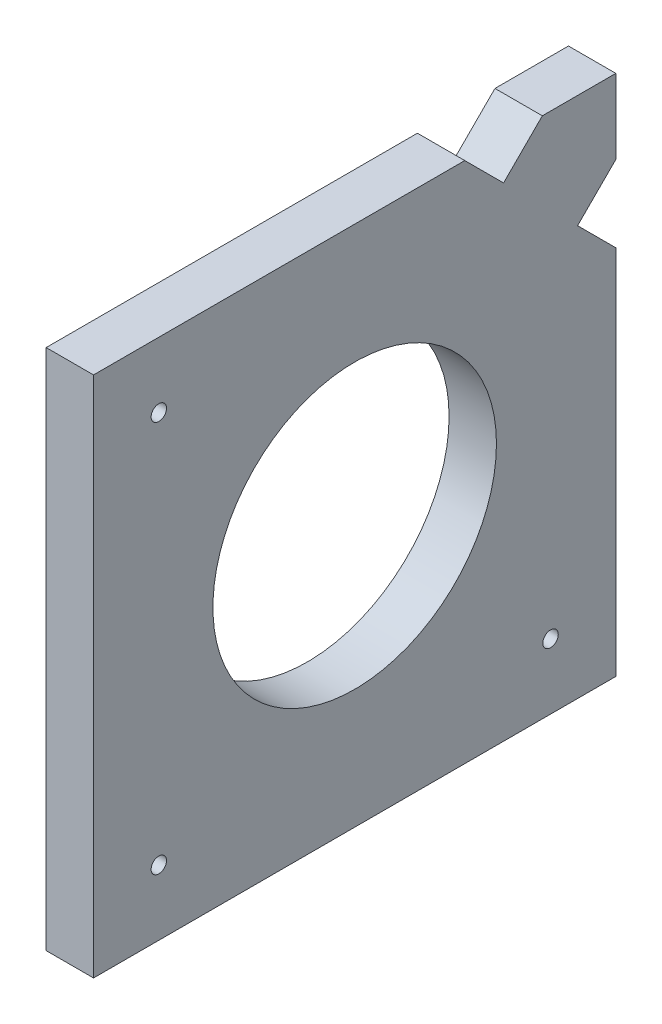
ISO-10303-21;
HEADER;
FILE_DESCRIPTION(('STEP AP214'),'2;1');
FILE_NAME('part.step','',(''),(''),'','','');
FILE_SCHEMA(('AUTOMOTIVE_DESIGN { 1 0 10303 214 1 1 1 1 }'));
ENDSEC;
DATA;
#1=APPLICATION_CONTEXT('core data for automotive mechanical design processes');
#2=APPLICATION_PROTOCOL_DEFINITION('international standard','automotive_design',2000,#1);
#3=PRODUCT_CONTEXT('',#1,'mechanical');
#4=PRODUCT('Part','Part','',(#3));
#5=PRODUCT_RELATED_PRODUCT_CATEGORY('part','',(#4));
#6=PRODUCT_DEFINITION_FORMATION('','',#4);
#7=PRODUCT_DEFINITION_CONTEXT('part definition',#1,'design');
#8=PRODUCT_DEFINITION('design','',#6,#7);
#9=PRODUCT_DEFINITION_SHAPE('','',#8);
#10=(LENGTH_UNIT() NAMED_UNIT(*) SI_UNIT(.MILLI.,.METRE.));
#11=(NAMED_UNIT(*) PLANE_ANGLE_UNIT() SI_UNIT($,.RADIAN.));
#12=(NAMED_UNIT(*) SI_UNIT($,.STERADIAN.) SOLID_ANGLE_UNIT());
#13=UNCERTAINTY_MEASURE_WITH_UNIT(LENGTH_MEASURE(1.E-05),#10,'distance_accuracy_value','');
#14=(GEOMETRIC_REPRESENTATION_CONTEXT(3) GLOBAL_UNCERTAINTY_ASSIGNED_CONTEXT((#13)) GLOBAL_UNIT_ASSIGNED_CONTEXT((#10,
#11,#12)) REPRESENTATION_CONTEXT('',''));
#15=CARTESIAN_POINT('',(0.,0.,0.));
#16=DIRECTION('',(0.,0.,1.));
#17=DIRECTION('',(1.,0.,0.));
#18=AXIS2_PLACEMENT_3D('',#15,#16,#17);
#19=CARTESIAN_POINT('',(6.35,0.,0.));
#20=DIRECTION('',(-1.,0.,0.));
#21=DIRECTION('',(0.,0.,1.));
#22=AXIS2_PLACEMENT_3D('',#19,#20,#21);
#23=PLANE('',#22);
#24=CARTESIAN_POINT('',(6.35,8.75000000000002,-61.25));
#25=DIRECTION('',(1.,0.,0.));
#26=DIRECTION('',(0.,0.,-1.));
#27=AXIS2_PLACEMENT_3D('',#24,#25,#26);
#28=CIRCLE('',#27,1.03251);
#29=CARTESIAN_POINT('',(6.35,8.75000000000002,-62.28251));
#30=VERTEX_POINT('',#29);
#31=EDGE_CURVE('E226',#30,#30,#28,.T.);
#32=ORIENTED_EDGE('',*,*,#31,.F.);
#33=EDGE_LOOP('',(#32));
#34=FACE_BOUND('',#33,.T.);
#35=CARTESIAN_POINT('',(6.35,8.75000000000002,-8.74999999999999));
#36=DIRECTION('',(1.,0.,0.));
#37=DIRECTION('',(0.,0.,1.));
#38=AXIS2_PLACEMENT_3D('',#35,#36,#37);
#39=CIRCLE('',#38,1.03251);
#40=CARTESIAN_POINT('',(6.35,8.75000000000002,-7.71748999999999));
#41=VERTEX_POINT('',#40);
#42=EDGE_CURVE('E220',#41,#41,#39,.T.);
#43=ORIENTED_EDGE('',*,*,#42,.F.);
#44=EDGE_LOOP('',(#43));
#45=FACE_BOUND('',#44,.T.);
#46=CARTESIAN_POINT('',(6.35,61.25,-8.74999999999999));
#47=DIRECTION('',(1.,0.,0.));
#48=DIRECTION('',(0.,0.,-1.));
#49=AXIS2_PLACEMENT_3D('',#46,#47,#48);
#50=CIRCLE('',#49,1.03251);
#51=CARTESIAN_POINT('',(6.35,61.25,-9.78250999999999));
#52=VERTEX_POINT('',#51);
#53=EDGE_CURVE('E214',#52,#52,#50,.T.);
#54=ORIENTED_EDGE('',*,*,#53,.F.);
#55=EDGE_LOOP('',(#54));
#56=FACE_BOUND('',#55,.T.);
#57=DIRECTION('',(0.,-1.,0.));
#58=VECTOR('',#57,1.);
#59=CARTESIAN_POINT('',(6.35,0.,0.));
#60=LINE('',#59,#58);
#61=CARTESIAN_POINT('',(6.35,70.,0.));
#62=VERTEX_POINT('',#61);
#63=CARTESIAN_POINT('',(6.35,0.,0.));
#64=VERTEX_POINT('',#63);
#65=EDGE_CURVE('E160',#62,#64,#60,.T.);
#66=ORIENTED_EDGE('',*,*,#65,.T.);
#67=DIRECTION('',(0.,0.,-1.));
#68=VECTOR('',#67,1.);
#69=CARTESIAN_POINT('',(6.35,0.,0.));
#70=LINE('',#69,#68);
#71=CARTESIAN_POINT('',(6.35,0.,-70.));
#72=VERTEX_POINT('',#71);
#73=EDGE_CURVE('E98',#64,#72,#70,.T.);
#74=ORIENTED_EDGE('',*,*,#73,.T.);
#75=DIRECTION('',(0.,1.,0.));
#76=VECTOR('',#75,1.);
#77=CARTESIAN_POINT('',(6.35,49.7566150142179,-70.));
#78=LINE('',#77,#76);
#79=CARTESIAN_POINT('',(6.35,49.7566150142179,-70.));
#80=VERTEX_POINT('',#79);
#81=EDGE_CURVE('E181',#72,#80,#78,.T.);
#82=ORIENTED_EDGE('',*,*,#81,.T.);
#83=DIRECTION('',(0.,0.707106781186539,0.707106781186556));
#84=VECTOR('',#83,1.);
#85=CARTESIAN_POINT('',(6.35,54.8841313668253,-64.8724836473926));
#86=LINE('',#85,#84);
#87=CARTESIAN_POINT('',(6.35,54.8841313668253,-64.8724836473926));
#88=VERTEX_POINT('',#87);
#89=EDGE_CURVE('E200',#80,#88,#86,.T.);
#90=ORIENTED_EDGE('',*,*,#89,.T.);
#91=DIRECTION('',(0.,0.707106781186557,-0.707106781186538));
#92=VECTOR('',#91,1.);
#93=CARTESIAN_POINT('',(6.35,60.0116477194329,-70.));
#94=LINE('',#93,#92);
#95=CARTESIAN_POINT('',(6.35,60.0116477194329,-70.));
#96=VERTEX_POINT('',#95);
#97=EDGE_CURVE('E197',#88,#96,#94,.T.);
#98=ORIENTED_EDGE('',*,*,#97,.T.);
#99=DIRECTION('',(0.,1.,0.));
#100=VECTOR('',#99,1.);
#101=CARTESIAN_POINT('',(6.35,70.,-70.));
#102=LINE('',#101,#100);
#103=CARTESIAN_POINT('',(6.35,70.,-70.));
#104=VERTEX_POINT('',#103);
#105=EDGE_CURVE('E199',#96,#104,#102,.T.);
#106=ORIENTED_EDGE('',*,*,#105,.T.);
#107=DIRECTION('',(0.,0.,1.));
#108=VECTOR('',#107,1.);
#109=CARTESIAN_POINT('',(6.35,70.,-60.1486352668631));
#110=LINE('',#109,#108);
#111=CARTESIAN_POINT('',(6.35,70.,-60.1486352668631));
#112=VERTEX_POINT('',#111);
#113=EDGE_CURVE('E123',#104,#112,#110,.T.);
#114=ORIENTED_EDGE('',*,*,#113,.T.);
#115=DIRECTION('',(0.,-0.707106781186557,0.707106781186538));
#116=VECTOR('',#115,1.);
#117=CARTESIAN_POINT('',(6.35,64.8039898736772,-54.9526251405404));
#118=LINE('',#117,#116);
#119=CARTESIAN_POINT('',(6.35,64.8039898736772,-54.9526251405404));
#120=VERTEX_POINT('',#119);
#121=EDGE_CURVE('E117',#112,#120,#118,.T.);
#122=ORIENTED_EDGE('',*,*,#121,.T.);
#123=DIRECTION('',(0.,0.707106781186539,0.707106781186556));
#124=VECTOR('',#123,1.);
#125=CARTESIAN_POINT('',(6.35,64.8039898736772,-54.9526251405404));
#126=LINE('',#125,#124);
#127=CARTESIAN_POINT('',(6.35,70.,-49.7566150142174));
#128=VERTEX_POINT('',#127);
#129=EDGE_CURVE('E121',#120,#128,#126,.T.);
#130=ORIENTED_EDGE('',*,*,#129,.T.);
#131=DIRECTION('',(0.,0.,1.));
#132=VECTOR('',#131,1.);
#133=CARTESIAN_POINT('',(6.35,70.,0.));
#134=LINE('',#133,#132);
#135=EDGE_CURVE('E49',#128,#62,#134,.T.);
#136=ORIENTED_EDGE('',*,*,#135,.T.);
#137=EDGE_LOOP('',(#66,#74,#82,#90,#98,#106,#114,#122,#130,#136));
#138=FACE_BOUND('',#137,.T.);
#139=CARTESIAN_POINT('',(6.35,35.,-35.));
#140=DIRECTION('',(1.,0.,0.));
#141=DIRECTION('',(0.,0.,-1.));
#142=AXIS2_PLACEMENT_3D('',#139,#140,#141);
#143=CIRCLE('',#142,19.);
#144=CARTESIAN_POINT('',(6.35,35.,-54.));
#145=VERTEX_POINT('',#144);
#146=EDGE_CURVE('E145',#145,#145,#143,.T.);
#147=ORIENTED_EDGE('',*,*,#146,.F.);
#148=EDGE_LOOP('',(#147));
#149=FACE_BOUND('',#148,.T.);
#150=ADVANCED_FACE('F32',(#34,#45,#56,#138,#149),#23,.F.);
#151=CARTESIAN_POINT('',(0.,0.,0.));
#152=DIRECTION('',(-1.,0.,0.));
#153=DIRECTION('',(0.,0.,1.));
#154=AXIS2_PLACEMENT_3D('',#151,#152,#153);
#155=PLANE('',#154);
#156=CARTESIAN_POINT('',(0.,8.75000000000002,-61.25));
#157=DIRECTION('',(1.,0.,0.));
#158=DIRECTION('',(0.,0.,-1.));
#159=AXIS2_PLACEMENT_3D('',#156,#157,#158);
#160=CIRCLE('',#159,1.03251);
#161=CARTESIAN_POINT('',(0.,8.75000000000002,-62.28251));
#162=VERTEX_POINT('',#161);
#163=EDGE_CURVE('E223',#162,#162,#160,.T.);
#164=ORIENTED_EDGE('',*,*,#163,.T.);
#165=EDGE_LOOP('',(#164));
#166=FACE_BOUND('',#165,.T.);
#167=CARTESIAN_POINT('',(0.,8.75000000000002,-8.74999999999999));
#168=DIRECTION('',(1.,0.,0.));
#169=DIRECTION('',(0.,0.,1.));
#170=AXIS2_PLACEMENT_3D('',#167,#168,#169);
#171=CIRCLE('',#170,1.03251);
#172=CARTESIAN_POINT('',(0.,8.75000000000002,-7.71748999999999));
#173=VERTEX_POINT('',#172);
#174=EDGE_CURVE('E217',#173,#173,#171,.T.);
#175=ORIENTED_EDGE('',*,*,#174,.T.);
#176=EDGE_LOOP('',(#175));
#177=FACE_BOUND('',#176,.T.);
#178=CARTESIAN_POINT('',(0.,61.25,-8.74999999999999));
#179=DIRECTION('',(1.,0.,0.));
#180=DIRECTION('',(0.,0.,-1.));
#181=AXIS2_PLACEMENT_3D('',#178,#179,#180);
#182=CIRCLE('',#181,1.03251);
#183=CARTESIAN_POINT('',(0.,61.25,-9.78250999999999));
#184=VERTEX_POINT('',#183);
#185=EDGE_CURVE('E211',#184,#184,#182,.T.);
#186=ORIENTED_EDGE('',*,*,#185,.T.);
#187=EDGE_LOOP('',(#186));
#188=FACE_BOUND('',#187,.T.);
#189=DIRECTION('',(0.,-1.,0.));
#190=VECTOR('',#189,1.);
#191=CARTESIAN_POINT('',(0.,0.,0.));
#192=LINE('',#191,#190);
#193=CARTESIAN_POINT('',(0.,70.,0.));
#194=VERTEX_POINT('',#193);
#195=CARTESIAN_POINT('',(0.,0.,0.));
#196=VERTEX_POINT('',#195);
#197=EDGE_CURVE('E141',#194,#196,#192,.T.);
#198=ORIENTED_EDGE('',*,*,#197,.F.);
#199=DIRECTION('',(0.,0.,1.));
#200=VECTOR('',#199,1.);
#201=CARTESIAN_POINT('',(0.,70.,0.));
#202=LINE('',#201,#200);
#203=CARTESIAN_POINT('',(0.,70.,-49.7566150142174));
#204=VERTEX_POINT('',#203);
#205=EDGE_CURVE('E90',#204,#194,#202,.T.);
#206=ORIENTED_EDGE('',*,*,#205,.F.);
#207=DIRECTION('',(0.,0.707106781186539,0.707106781186556));
#208=VECTOR('',#207,1.);
#209=CARTESIAN_POINT('',(0.,64.8039898736772,-54.9526251405404));
#210=LINE('',#209,#208);
#211=CARTESIAN_POINT('',(0.,64.8039898736772,-54.9526251405404));
#212=VERTEX_POINT('',#211);
#213=EDGE_CURVE('E84',#212,#204,#210,.T.);
#214=ORIENTED_EDGE('',*,*,#213,.F.);
#215=DIRECTION('',(0.,-0.707106781186557,0.707106781186538));
#216=VECTOR('',#215,1.);
#217=CARTESIAN_POINT('',(0.,64.8039898736772,-54.9526251405404));
#218=LINE('',#217,#216);
#219=CARTESIAN_POINT('',(0.,70.,-60.1486352668631));
#220=VERTEX_POINT('',#219);
#221=EDGE_CURVE('E131',#220,#212,#218,.T.);
#222=ORIENTED_EDGE('',*,*,#221,.F.);
#223=DIRECTION('',(0.,0.,1.));
#224=VECTOR('',#223,1.);
#225=CARTESIAN_POINT('',(0.,70.,-60.1486352668631));
#226=LINE('',#225,#224);
#227=CARTESIAN_POINT('',(0.,70.,-70.));
#228=VERTEX_POINT('',#227);
#229=EDGE_CURVE('E155',#228,#220,#226,.T.);
#230=ORIENTED_EDGE('',*,*,#229,.F.);
#231=DIRECTION('',(0.,1.,0.));
#232=VECTOR('',#231,1.);
#233=CARTESIAN_POINT('',(0.,70.,-70.));
#234=LINE('',#233,#232);
#235=CARTESIAN_POINT('',(0.,60.0116477194329,-70.));
#236=VERTEX_POINT('',#235);
#237=EDGE_CURVE('E153',#236,#228,#234,.T.);
#238=ORIENTED_EDGE('',*,*,#237,.F.);
#239=DIRECTION('',(0.,0.707106781186557,-0.707106781186538));
#240=VECTOR('',#239,1.);
#241=CARTESIAN_POINT('',(0.,60.0116477194329,-70.));
#242=LINE('',#241,#240);
#243=CARTESIAN_POINT('',(0.,54.8841313668253,-64.8724836473926));
#244=VERTEX_POINT('',#243);
#245=EDGE_CURVE('E151',#244,#236,#242,.T.);
#246=ORIENTED_EDGE('',*,*,#245,.F.);
#247=DIRECTION('',(0.,0.707106781186539,0.707106781186556));
#248=VECTOR('',#247,1.);
#249=CARTESIAN_POINT('',(0.,54.8841313668253,-64.8724836473926));
#250=LINE('',#249,#248);
#251=CARTESIAN_POINT('',(0.,49.7566150142179,-70.));
#252=VERTEX_POINT('',#251);
#253=EDGE_CURVE('E149',#252,#244,#250,.T.);
#254=ORIENTED_EDGE('',*,*,#253,.F.);
#255=DIRECTION('',(0.,1.,0.));
#256=VECTOR('',#255,1.);
#257=CARTESIAN_POINT('',(0.,49.7566150142179,-70.));
#258=LINE('',#257,#256);
#259=CARTESIAN_POINT('',(0.,0.,-70.));
#260=VERTEX_POINT('',#259);
#261=EDGE_CURVE('E147',#260,#252,#258,.T.);
#262=ORIENTED_EDGE('',*,*,#261,.F.);
#263=DIRECTION('',(0.,0.,-1.));
#264=VECTOR('',#263,1.);
#265=CARTESIAN_POINT('',(0.,0.,0.));
#266=LINE('',#265,#264);
#267=EDGE_CURVE('E144',#196,#260,#266,.T.);
#268=ORIENTED_EDGE('',*,*,#267,.F.);
#269=EDGE_LOOP('',(#198,#206,#214,#222,#230,#238,#246,#254,#262,#268));
#270=FACE_BOUND('',#269,.T.);
#271=CARTESIAN_POINT('',(0.,35.,-35.));
#272=DIRECTION('',(1.,0.,0.));
#273=DIRECTION('',(0.,0.,-1.));
#274=AXIS2_PLACEMENT_3D('',#271,#272,#273);
#275=CIRCLE('',#274,19.);
#276=CARTESIAN_POINT('',(0.,35.,-54.));
#277=VERTEX_POINT('',#276);
#278=EDGE_CURVE('E208',#277,#277,#275,.T.);
#279=ORIENTED_EDGE('',*,*,#278,.T.);
#280=EDGE_LOOP('',(#279));
#281=FACE_BOUND('',#280,.T.);
#282=ADVANCED_FACE('F185',(#166,#177,#188,#270,#281),#155,.T.);
#283=CARTESIAN_POINT('',(6.35,0.,0.));
#284=DIRECTION('',(0.,0.,-1.));
#285=DIRECTION('',(0.,1.,0.));
#286=AXIS2_PLACEMENT_3D('',#283,#284,#285);
#287=PLANE('',#286);
#288=ORIENTED_EDGE('',*,*,#197,.T.);
#289=DIRECTION('',(-1.,0.,0.));
#290=VECTOR('',#289,1.);
#291=CARTESIAN_POINT('',(6.35,0.,0.));
#292=LINE('',#291,#290);
#293=EDGE_CURVE('E11',#64,#196,#292,.T.);
#294=ORIENTED_EDGE('',*,*,#293,.F.);
#295=ORIENTED_EDGE('',*,*,#65,.F.);
#296=DIRECTION('',(-1.,0.,0.));
#297=VECTOR('',#296,1.);
#298=CARTESIAN_POINT('',(6.35,70.,0.));
#299=LINE('',#298,#297);
#300=EDGE_CURVE('E137',#62,#194,#299,.T.);
#301=ORIENTED_EDGE('',*,*,#300,.T.);
#302=EDGE_LOOP('',(#288,#294,#295,#301));
#303=FACE_BOUND('',#302,.T.);
#304=ADVANCED_FACE('F34',(#303),#287,.F.);
#305=CARTESIAN_POINT('',(6.35,0.,0.));
#306=DIRECTION('',(0.,1.,0.));
#307=DIRECTION('',(0.,0.,1.));
#308=AXIS2_PLACEMENT_3D('',#305,#306,#307);
#309=PLANE('',#308);
#310=ORIENTED_EDGE('',*,*,#267,.T.);
#311=DIRECTION('',(-1.,0.,0.));
#312=VECTOR('',#311,1.);
#313=CARTESIAN_POINT('',(6.35,0.,-70.));
#314=LINE('',#313,#312);
#315=EDGE_CURVE('E41',#72,#260,#314,.T.);
#316=ORIENTED_EDGE('',*,*,#315,.F.);
#317=ORIENTED_EDGE('',*,*,#73,.F.);
#318=ORIENTED_EDGE('',*,*,#293,.T.);
#319=EDGE_LOOP('',(#310,#316,#317,#318));
#320=FACE_BOUND('',#319,.T.);
#321=ADVANCED_FACE('F285',(#320),#309,.F.);
#322=CARTESIAN_POINT('',(6.35,49.7566150142179,-70.));
#323=DIRECTION('',(0.,0.,1.));
#324=DIRECTION('',(1.,0.,0.));
#325=AXIS2_PLACEMENT_3D('',#322,#323,#324);
#326=PLANE('',#325);
#327=ORIENTED_EDGE('',*,*,#261,.T.);
#328=DIRECTION('',(-1.,0.,0.));
#329=VECTOR('',#328,1.);
#330=CARTESIAN_POINT('',(6.35,49.7566150142179,-70.));
#331=LINE('',#330,#329);
#332=EDGE_CURVE('E173',#80,#252,#331,.T.);
#333=ORIENTED_EDGE('',*,*,#332,.F.);
#334=ORIENTED_EDGE('',*,*,#81,.F.);
#335=ORIENTED_EDGE('',*,*,#315,.T.);
#336=EDGE_LOOP('',(#327,#333,#334,#335));
#337=FACE_BOUND('',#336,.T.);
#338=ADVANCED_FACE('F179',(#337),#326,.F.);
#339=CARTESIAN_POINT('',(6.35,54.8841313668253,-64.8724836473926));
#340=DIRECTION('',(0.,-0.707106781186556,0.707106781186539));
#341=DIRECTION('',(0.,-0.707106781186539,-0.707106781186556));
#342=AXIS2_PLACEMENT_3D('',#339,#340,#341);
#343=PLANE('',#342);
#344=ORIENTED_EDGE('',*,*,#253,.T.);
#345=DIRECTION('',(-1.,0.,0.));
#346=VECTOR('',#345,1.);
#347=CARTESIAN_POINT('',(6.35,54.8841313668253,-64.8724836473926));
#348=LINE('',#347,#346);
#349=EDGE_CURVE('E170',#88,#244,#348,.T.);
#350=ORIENTED_EDGE('',*,*,#349,.F.);
#351=ORIENTED_EDGE('',*,*,#89,.F.);
#352=ORIENTED_EDGE('',*,*,#332,.T.);
#353=EDGE_LOOP('',(#344,#350,#351,#352));
#354=FACE_BOUND('',#353,.T.);
#355=ADVANCED_FACE('F191',(#354),#343,.F.);
#356=CARTESIAN_POINT('',(6.35,60.0116477194329,-70.));
#357=DIRECTION('',(0.,0.707106781186538,0.707106781186557));
#358=DIRECTION('',(0.,-0.707106781186557,0.707106781186538));
#359=AXIS2_PLACEMENT_3D('',#356,#357,#358);
#360=PLANE('',#359);
#361=ORIENTED_EDGE('',*,*,#245,.T.);
#362=DIRECTION('',(-1.,0.,0.));
#363=VECTOR('',#362,1.);
#364=CARTESIAN_POINT('',(6.35,60.0116477194329,-70.));
#365=LINE('',#364,#363);
#366=EDGE_CURVE('E167',#96,#236,#365,.T.);
#367=ORIENTED_EDGE('',*,*,#366,.F.);
#368=ORIENTED_EDGE('',*,*,#97,.F.);
#369=ORIENTED_EDGE('',*,*,#349,.T.);
#370=EDGE_LOOP('',(#361,#367,#368,#369));
#371=FACE_BOUND('',#370,.T.);
#372=ADVANCED_FACE('F195',(#371),#360,.F.);
#373=CARTESIAN_POINT('',(6.35,70.,-70.));
#374=DIRECTION('',(0.,0.,1.));
#375=DIRECTION('',(1.,0.,0.));
#376=AXIS2_PLACEMENT_3D('',#373,#374,#375);
#377=PLANE('',#376);
#378=ORIENTED_EDGE('',*,*,#237,.T.);
#379=DIRECTION('',(-1.,0.,0.));
#380=VECTOR('',#379,1.);
#381=CARTESIAN_POINT('',(6.35,70.,-70.));
#382=LINE('',#381,#380);
#383=EDGE_CURVE('E164',#104,#228,#382,.T.);
#384=ORIENTED_EDGE('',*,*,#383,.F.);
#385=ORIENTED_EDGE('',*,*,#105,.F.);
#386=ORIENTED_EDGE('',*,*,#366,.T.);
#387=EDGE_LOOP('',(#378,#384,#385,#386));
#388=FACE_BOUND('',#387,.T.);
#389=ADVANCED_FACE('F275',(#388),#377,.F.);
#390=CARTESIAN_POINT('',(6.35,70.,-60.1486352668631));
#391=DIRECTION('',(0.,-1.,0.));
#392=DIRECTION('',(0.,0.,-1.));
#393=AXIS2_PLACEMENT_3D('',#390,#391,#392);
#394=PLANE('',#393);
#395=ORIENTED_EDGE('',*,*,#229,.T.);
#396=DIRECTION('',(-1.,0.,0.));
#397=VECTOR('',#396,1.);
#398=CARTESIAN_POINT('',(6.35,70.,-60.1486352668631));
#399=LINE('',#398,#397);
#400=EDGE_CURVE('E132',#112,#220,#399,.T.);
#401=ORIENTED_EDGE('',*,*,#400,.F.);
#402=ORIENTED_EDGE('',*,*,#113,.F.);
#403=ORIENTED_EDGE('',*,*,#383,.T.);
#404=EDGE_LOOP('',(#395,#401,#402,#403));
#405=FACE_BOUND('',#404,.T.);
#406=ADVANCED_FACE('F272',(#405),#394,.F.);
#407=CARTESIAN_POINT('',(6.35,64.8039898736772,-54.9526251405404));
#408=DIRECTION('',(0.,-0.707106781186538,-0.707106781186557));
#409=DIRECTION('',(0.,0.707106781186557,-0.707106781186538));
#410=AXIS2_PLACEMENT_3D('',#407,#408,#409);
#411=PLANE('',#410);
#412=ORIENTED_EDGE('',*,*,#221,.T.);
#413=DIRECTION('',(-1.,0.,0.));
#414=VECTOR('',#413,1.);
#415=CARTESIAN_POINT('',(6.35,64.8039898736772,-54.9526251405404));
#416=LINE('',#415,#414);
#417=EDGE_CURVE('E128',#120,#212,#416,.T.);
#418=ORIENTED_EDGE('',*,*,#417,.F.);
#419=ORIENTED_EDGE('',*,*,#121,.F.);
#420=ORIENTED_EDGE('',*,*,#400,.T.);
#421=EDGE_LOOP('',(#412,#418,#419,#420));
#422=FACE_BOUND('',#421,.T.);
#423=ADVANCED_FACE('F129',(#422),#411,.F.);
#424=CARTESIAN_POINT('',(6.35,64.8039898736772,-54.9526251405404));
#425=DIRECTION('',(0.,-0.707106781186556,0.707106781186539));
#426=DIRECTION('',(0.,-0.707106781186539,-0.707106781186556));
#427=AXIS2_PLACEMENT_3D('',#424,#425,#426);
#428=PLANE('',#427);
#429=ORIENTED_EDGE('',*,*,#213,.T.);
#430=DIRECTION('',(-1.,0.,0.));
#431=VECTOR('',#430,1.);
#432=CARTESIAN_POINT('',(6.35,70.,-49.7566150142174));
#433=LINE('',#432,#431);
#434=EDGE_CURVE('E133',#128,#204,#433,.T.);
#435=ORIENTED_EDGE('',*,*,#434,.F.);
#436=ORIENTED_EDGE('',*,*,#129,.F.);
#437=ORIENTED_EDGE('',*,*,#417,.T.);
#438=EDGE_LOOP('',(#429,#435,#436,#437));
#439=FACE_BOUND('',#438,.T.);
#440=ADVANCED_FACE('F135',(#439),#428,.F.);
#441=CARTESIAN_POINT('',(6.35,70.,0.));
#442=DIRECTION('',(0.,-1.,0.));
#443=DIRECTION('',(0.,0.,-1.));
#444=AXIS2_PLACEMENT_3D('',#441,#442,#443);
#445=PLANE('',#444);
#446=ORIENTED_EDGE('',*,*,#205,.T.);
#447=ORIENTED_EDGE('',*,*,#300,.F.);
#448=ORIENTED_EDGE('',*,*,#135,.F.);
#449=ORIENTED_EDGE('',*,*,#434,.T.);
#450=EDGE_LOOP('',(#446,#447,#448,#449));
#451=FACE_BOUND('',#450,.T.);
#452=ADVANCED_FACE('F259',(#451),#445,.F.);
#453=CARTESIAN_POINT('',(6.35,35.,-35.));
#454=DIRECTION('',(-1.,0.,0.));
#455=DIRECTION('',(0.,0.,1.));
#456=AXIS2_PLACEMENT_3D('',#453,#454,#455);
#457=CYLINDRICAL_SURFACE('',#456,19.);
#458=ORIENTED_EDGE('',*,*,#146,.T.);
#459=EDGE_LOOP('',(#458));
#460=FACE_BOUND('',#459,.T.);
#461=ORIENTED_EDGE('',*,*,#278,.F.);
#462=EDGE_LOOP('',(#461));
#463=FACE_BOUND('',#462,.T.);
#464=ADVANCED_FACE('F250',(#460,#463),#457,.F.);
#465=CARTESIAN_POINT('',(0.,61.25,-8.74999999999999));
#466=DIRECTION('',(1.,0.,0.));
#467=DIRECTION('',(0.,0.,-1.));
#468=AXIS2_PLACEMENT_3D('',#465,#466,#467);
#469=CYLINDRICAL_SURFACE('',#468,1.03251);
#470=ORIENTED_EDGE('',*,*,#185,.F.);
#471=EDGE_LOOP('',(#470));
#472=FACE_BOUND('',#471,.T.);
#473=ORIENTED_EDGE('',*,*,#53,.T.);
#474=EDGE_LOOP('',(#473));
#475=FACE_BOUND('',#474,.T.);
#476=ADVANCED_FACE('F248',(#472,#475),#469,.F.);
#477=CARTESIAN_POINT('',(0.,8.75000000000002,-8.74999999999999));
#478=DIRECTION('',(1.,0.,0.));
#479=DIRECTION('',(0.,0.,-1.));
#480=AXIS2_PLACEMENT_3D('',#477,#478,#479);
#481=CYLINDRICAL_SURFACE('',#480,1.03251);
#482=ORIENTED_EDGE('',*,*,#174,.F.);
#483=EDGE_LOOP('',(#482));
#484=FACE_BOUND('',#483,.T.);
#485=ORIENTED_EDGE('',*,*,#42,.T.);
#486=EDGE_LOOP('',(#485));
#487=FACE_BOUND('',#486,.T.);
#488=ADVANCED_FACE('F237',(#484,#487),#481,.F.);
#489=CARTESIAN_POINT('',(0.,8.75000000000002,-61.25));
#490=DIRECTION('',(1.,0.,0.));
#491=DIRECTION('',(0.,0.,-1.));
#492=AXIS2_PLACEMENT_3D('',#489,#490,#491);
#493=CYLINDRICAL_SURFACE('',#492,1.03251);
#494=ORIENTED_EDGE('',*,*,#163,.F.);
#495=EDGE_LOOP('',(#494));
#496=FACE_BOUND('',#495,.T.);
#497=ORIENTED_EDGE('',*,*,#31,.T.);
#498=EDGE_LOOP('',(#497));
#499=FACE_BOUND('',#498,.T.);
#500=ADVANCED_FACE('F234',(#496,#499),#493,.F.);
#501=CLOSED_SHELL('',(#150,#282,#304,#321,#338,#355,#372,#389,#406,#423,#440,#452,#464,#476,
#488,#500));
#502=MANIFOLD_SOLID_BREP('B2',#501);
#503=ADVANCED_BREP_SHAPE_REPRESENTATION('',(#18,#502),#14);
#504=SHAPE_DEFINITION_REPRESENTATION(#9,#503);
ENDSEC;
END-ISO-10303-21;
